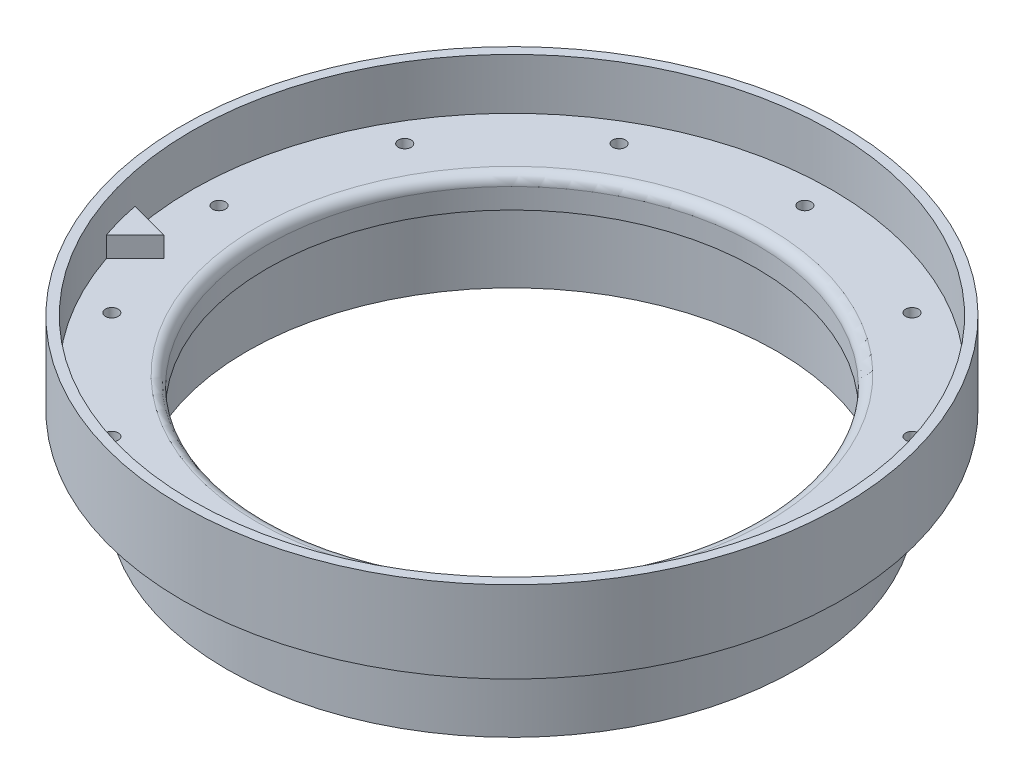
ISO-10303-21;
HEADER;
FILE_DESCRIPTION(('STEP AP214'),'2;1');
FILE_NAME('part.step','',(''),(''),'','','');
FILE_SCHEMA(('AUTOMOTIVE_DESIGN { 1 0 10303 214 1 1 1 1 }'));
ENDSEC;
DATA;
#1=APPLICATION_CONTEXT('core data for automotive mechanical design processes');
#2=APPLICATION_PROTOCOL_DEFINITION('international standard','automotive_design',2000,#1);
#3=PRODUCT_CONTEXT('',#1,'mechanical');
#4=PRODUCT('Part','Part','',(#3));
#5=PRODUCT_RELATED_PRODUCT_CATEGORY('part','',(#4));
#6=PRODUCT_DEFINITION_FORMATION('','',#4);
#7=PRODUCT_DEFINITION_CONTEXT('part definition',#1,'design');
#8=PRODUCT_DEFINITION('design','',#6,#7);
#9=PRODUCT_DEFINITION_SHAPE('','',#8);
#10=(LENGTH_UNIT() NAMED_UNIT(*) SI_UNIT(.MILLI.,.METRE.));
#11=(NAMED_UNIT(*) PLANE_ANGLE_UNIT() SI_UNIT($,.RADIAN.));
#12=(NAMED_UNIT(*) SI_UNIT($,.STERADIAN.) SOLID_ANGLE_UNIT());
#13=UNCERTAINTY_MEASURE_WITH_UNIT(LENGTH_MEASURE(1.E-05),#10,'distance_accuracy_value','');
#14=(GEOMETRIC_REPRESENTATION_CONTEXT(3) GLOBAL_UNCERTAINTY_ASSIGNED_CONTEXT((#13)) GLOBAL_UNIT_ASSIGNED_CONTEXT((#10,
#11,#12)) REPRESENTATION_CONTEXT('',''));
#15=CARTESIAN_POINT('',(0.,0.,0.));
#16=DIRECTION('',(0.,0.,1.));
#17=DIRECTION('',(1.,0.,0.));
#18=AXIS2_PLACEMENT_3D('',#15,#16,#17);
#19=CARTESIAN_POINT('',(0.,55.,0.));
#20=DIRECTION('',(0.,1.,0.));
#21=DIRECTION('',(0.,0.,1.));
#22=AXIS2_PLACEMENT_3D('',#19,#20,#21);
#23=CYLINDRICAL_SURFACE('',#22,49.784);
#24=CARTESIAN_POINT('',(0.,9.525,0.));
#25=DIRECTION('',(0.,1.,0.));
#26=DIRECTION('',(0.,0.,1.));
#27=AXIS2_PLACEMENT_3D('',#24,#25,#26);
#28=CIRCLE('',#27,49.784);
#29=CARTESIAN_POINT('',(0.,9.525,49.784));
#30=VERTEX_POINT('',#29);
#31=EDGE_CURVE('E169',#30,#30,#28,.T.);
#32=ORIENTED_EDGE('',*,*,#31,.T.);
#33=EDGE_LOOP('',(#32));
#34=FACE_BOUND('',#33,.T.);
#35=CARTESIAN_POINT('',(0.,1.5875,0.));
#36=DIRECTION('',(0.,1.,0.));
#37=DIRECTION('',(0.,0.,1.));
#38=AXIS2_PLACEMENT_3D('',#35,#36,#37);
#39=CIRCLE('',#38,49.784);
#40=CARTESIAN_POINT('',(-47.1680073957675,1.5875,15.9256313630832));
#41=VERTEX_POINT('',#40);
#42=CARTESIAN_POINT('',(-48.8115083321686,1.5875,9.79200236614763));
#43=VERTEX_POINT('',#42);
#44=EDGE_CURVE('E86',#41,#43,#39,.T.);
#45=ORIENTED_EDGE('',*,*,#44,.F.);
#46=DIRECTION('',(0.,-1.,0.));
#47=VECTOR('',#46,1.);
#48=CARTESIAN_POINT('',(-47.1680073957675,4.7625,15.9256313630832));
#49=LINE('',#48,#47);
#50=CARTESIAN_POINT('',(-47.1680073957675,4.7625,15.9256313630832));
#51=VERTEX_POINT('',#50);
#52=EDGE_CURVE('E76',#51,#41,#49,.T.);
#53=ORIENTED_EDGE('',*,*,#52,.F.);
#54=CARTESIAN_POINT('',(0.,4.7625,0.));
#55=DIRECTION('',(0.,1.,0.));
#56=DIRECTION('',(0.,0.,-1.));
#57=AXIS2_PLACEMENT_3D('',#54,#55,#56);
#58=CIRCLE('',#57,49.784);
#59=CARTESIAN_POINT('',(-48.8115083321686,4.7625,9.79200236614763));
#60=VERTEX_POINT('',#59);
#61=EDGE_CURVE('E78',#60,#51,#58,.T.);
#62=ORIENTED_EDGE('',*,*,#61,.F.);
#63=DIRECTION('',(0.,-1.,0.));
#64=VECTOR('',#63,1.);
#65=CARTESIAN_POINT('',(-48.8115083321686,4.7625,9.79200236614763));
#66=LINE('',#65,#64);
#67=EDGE_CURVE('E92',#60,#43,#66,.T.);
#68=ORIENTED_EDGE('',*,*,#67,.T.);
#69=EDGE_LOOP('',(#45,#53,#62,#68));
#70=FACE_BOUND('',#69,.T.);
#71=ADVANCED_FACE('F34',(#34,#70),#23,.F.);
#72=CARTESIAN_POINT('',(-39.6875,1.5875,0.));
#73=DIRECTION('',(0.,1.,0.));
#74=DIRECTION('',(0.,0.,1.));
#75=AXIS2_PLACEMENT_3D('',#72,#73,#74);
#76=PLANE('',#75);
#77=CARTESIAN_POINT('',(-39.4517006668589,1.58750000000002,-22.7774500000014));
#78=DIRECTION('',(0.,1.,0.));
#79=DIRECTION('',(0.,0.,1.));
#80=AXIS2_PLACEMENT_3D('',#77,#78,#79);
#81=CIRCLE('',#80,0.996949999999996);
#82=CARTESIAN_POINT('',(-39.4517006668589,1.58750000000002,-21.7805000000015));
#83=VERTEX_POINT('',#82);
#84=EDGE_CURVE('E87',#83,#83,#81,.T.);
#85=ORIENTED_EDGE('',*,*,#84,.F.);
#86=EDGE_LOOP('',(#85));
#87=FACE_BOUND('',#86,.T.);
#88=CARTESIAN_POINT('',(-22.7774499999985,1.58750000000008,-39.4517006668606));
#89=DIRECTION('',(0.,1.,0.));
#90=DIRECTION('',(0.,0.,1.));
#91=AXIS2_PLACEMENT_3D('',#88,#89,#90);
#92=CIRCLE('',#91,0.996949999999996);
#93=CARTESIAN_POINT('',(-22.7774499999985,1.58750000000007,-38.4547506668606));
#94=VERTEX_POINT('',#93);
#95=EDGE_CURVE('E98',#94,#94,#92,.T.);
#96=ORIENTED_EDGE('',*,*,#95,.F.);
#97=EDGE_LOOP('',(#96));
#98=FACE_BOUND('',#97,.T.);
#99=CARTESIAN_POINT('',(1.78253453346917E-12,1.58750000000016,-45.5549));
#100=DIRECTION('',(0.,1.,0.));
#101=DIRECTION('',(0.,0.,1.));
#102=AXIS2_PLACEMENT_3D('',#99,#100,#101);
#103=CIRCLE('',#102,0.996949999999998);
#104=CARTESIAN_POINT('',(1.78253453346917E-12,1.58750000000015,-44.55795));
#105=VERTEX_POINT('',#104);
#106=EDGE_CURVE('E104',#105,#105,#103,.T.);
#107=ORIENTED_EDGE('',*,*,#106,.F.);
#108=EDGE_LOOP('',(#107));
#109=FACE_BOUND('',#108,.T.);
#110=CARTESIAN_POINT('',(22.7774500000016,1.58750000000024,-39.4517006668588));
#111=DIRECTION('',(0.,1.,0.));
#112=DIRECTION('',(0.,0.,1.));
#113=AXIS2_PLACEMENT_3D('',#110,#111,#112);
#114=CIRCLE('',#113,0.996949999999996);
#115=CARTESIAN_POINT('',(22.7774500000016,1.58750000000023,-38.4547506668588));
#116=VERTEX_POINT('',#115);
#117=EDGE_CURVE('E110',#116,#116,#114,.T.);
#118=ORIENTED_EDGE('',*,*,#117,.F.);
#119=EDGE_LOOP('',(#118));
#120=FACE_BOUND('',#119,.T.);
#121=CARTESIAN_POINT('',(39.4517006668607,1.5875000000003,-22.7774499999984));
#122=DIRECTION('',(0.,1.,0.));
#123=DIRECTION('',(0.,0.,1.));
#124=AXIS2_PLACEMENT_3D('',#121,#122,#123);
#125=CIRCLE('',#124,0.996949999999996);
#126=CARTESIAN_POINT('',(39.4517006668607,1.58750000000029,-21.7804999999984));
#127=VERTEX_POINT('',#126);
#128=EDGE_CURVE('E113',#127,#127,#125,.T.);
#129=ORIENTED_EDGE('',*,*,#128,.F.);
#130=EDGE_LOOP('',(#129));
#131=FACE_BOUND('',#130,.T.);
#132=CARTESIAN_POINT('',(45.5549,1.58750000000032,2.26523950982318E-12));
#133=DIRECTION('',(0.,1.,0.));
#134=DIRECTION('',(0.,0.,1.));
#135=AXIS2_PLACEMENT_3D('',#132,#133,#134);
#136=CIRCLE('',#135,0.996949999999996);
#137=CARTESIAN_POINT('',(45.5549,1.58750000000032,0.996950000002262));
#138=VERTEX_POINT('',#137);
#139=EDGE_CURVE('E119',#138,#138,#136,.T.);
#140=ORIENTED_EDGE('',*,*,#139,.F.);
#141=EDGE_LOOP('',(#140));
#142=FACE_BOUND('',#141,.T.);
#143=CARTESIAN_POINT('',(39.4517006668587,1.5875000000003,22.7774500000017));
#144=DIRECTION('',(0.,1.,0.));
#145=DIRECTION('',(0.,0.,1.));
#146=AXIS2_PLACEMENT_3D('',#143,#144,#145);
#147=CIRCLE('',#146,0.996949999999996);
#148=CARTESIAN_POINT('',(39.4517006668587,1.5875000000003,23.7744000000017));
#149=VERTEX_POINT('',#148);
#150=EDGE_CURVE('E125',#149,#149,#147,.T.);
#151=ORIENTED_EDGE('',*,*,#150,.F.);
#152=EDGE_LOOP('',(#151));
#153=FACE_BOUND('',#152,.T.);
#154=CARTESIAN_POINT('',(22.7774499999982,1.58750000000024,39.4517006668607));
#155=DIRECTION('',(0.,1.,0.));
#156=DIRECTION('',(0.,0.,1.));
#157=AXIS2_PLACEMENT_3D('',#154,#155,#156);
#158=CIRCLE('',#157,0.996949999999996);
#159=CARTESIAN_POINT('',(22.7774499999982,1.58750000000024,40.4486506668607));
#160=VERTEX_POINT('',#159);
#161=EDGE_CURVE('E129',#160,#160,#158,.T.);
#162=ORIENTED_EDGE('',*,*,#161,.F.);
#163=EDGE_LOOP('',(#162));
#164=FACE_BOUND('',#163,.T.);
#165=CARTESIAN_POINT('',(-2.11172815320573E-12,1.58750000000016,45.5549));
#166=DIRECTION('',(0.,1.,0.));
#167=DIRECTION('',(0.,0.,1.));
#168=AXIS2_PLACEMENT_3D('',#165,#166,#167);
#169=CIRCLE('',#168,0.996949999999998);
#170=CARTESIAN_POINT('',(-2.11172815320573E-12,1.58750000000016,46.55185));
#171=VERTEX_POINT('',#170);
#172=EDGE_CURVE('E135',#171,#171,#169,.T.);
#173=ORIENTED_EDGE('',*,*,#172,.F.);
#174=EDGE_LOOP('',(#173));
#175=FACE_BOUND('',#174,.T.);
#176=CARTESIAN_POINT('',(-22.7774500000019,1.58750000000008,39.4517006668586));
#177=DIRECTION('',(0.,1.,0.));
#178=DIRECTION('',(0.,0.,1.));
#179=AXIS2_PLACEMENT_3D('',#176,#177,#178);
#180=CIRCLE('',#179,0.996949999999996);
#181=CARTESIAN_POINT('',(-22.7774500000019,1.58750000000008,40.4486506668586));
#182=VERTEX_POINT('',#181);
#183=EDGE_CURVE('E141',#182,#182,#180,.T.);
#184=ORIENTED_EDGE('',*,*,#183,.F.);
#185=EDGE_LOOP('',(#184));
#186=FACE_BOUND('',#185,.T.);
#187=CARTESIAN_POINT('',(-39.4517006668608,1.58750000000002,22.7774499999981));
#188=DIRECTION('',(0.,1.,0.));
#189=DIRECTION('',(0.,0.,1.));
#190=AXIS2_PLACEMENT_3D('',#187,#188,#189);
#191=CIRCLE('',#190,0.996949999999996);
#192=CARTESIAN_POINT('',(-39.4517006668608,1.58750000000002,23.7743999999981));
#193=VERTEX_POINT('',#192);
#194=EDGE_CURVE('E147',#193,#193,#191,.T.);
#195=ORIENTED_EDGE('',*,*,#194,.F.);
#196=EDGE_LOOP('',(#195));
#197=FACE_BOUND('',#196,.T.);
#198=CARTESIAN_POINT('',(-45.5549,1.5875,-2.26523950982318E-12));
#199=DIRECTION('',(0.,1.,0.));
#200=DIRECTION('',(0.,0.,1.));
#201=AXIS2_PLACEMENT_3D('',#198,#199,#200);
#202=CIRCLE('',#201,0.996949999999996);
#203=CARTESIAN_POINT('',(-45.5549,1.5875,0.996949999997731));
#204=VERTEX_POINT('',#203);
#205=EDGE_CURVE('E153',#204,#204,#202,.T.);
#206=ORIENTED_EDGE('',*,*,#205,.F.);
#207=EDGE_LOOP('',(#206));
#208=FACE_BOUND('',#207,.T.);
#209=CARTESIAN_POINT('',(0.,1.5875,0.));
#210=DIRECTION('',(0.,1.,0.));
#211=DIRECTION('',(0.,0.,1.));
#212=AXIS2_PLACEMENT_3D('',#209,#210,#211);
#213=CIRCLE('',#212,39.6875);
#214=CARTESIAN_POINT('',(0.,1.5875,39.6875));
#215=VERTEX_POINT('',#214);
#216=EDGE_CURVE('E165',#215,#215,#213,.T.);
#217=ORIENTED_EDGE('',*,*,#216,.F.);
#218=EDGE_LOOP('',(#217));
#219=FACE_BOUND('',#218,.T.);
#220=DIRECTION('',(-0.96592582628907,0.,-0.258819045102516));
#221=VECTOR('',#220,1.);
#222=CARTESIAN_POINT('',(-42.677879335233,1.5875,11.4355033025486));
#223=LINE('',#222,#221);
#224=CARTESIAN_POINT('',(-42.677879335233,1.5875,11.4355033025486));
#225=VERTEX_POINT('',#224);
#226=EDGE_CURVE('E69',#225,#43,#223,.T.);
#227=ORIENTED_EDGE('',*,*,#226,.F.);
#228=DIRECTION('',(0.707106781186547,0.,-0.707106781186547));
#229=VECTOR('',#228,1.);
#230=CARTESIAN_POINT('',(-47.1680073957675,1.5875,15.9256313630832));
#231=LINE('',#230,#229);
#232=EDGE_CURVE('E519',#41,#225,#231,.T.);
#233=ORIENTED_EDGE('',*,*,#232,.F.);
#234=ORIENTED_EDGE('',*,*,#44,.T.);
#235=EDGE_LOOP('',(#227,#233,#234));
#236=FACE_BOUND('',#235,.T.);
#237=ADVANCED_FACE('F225',(#87,#98,#109,#120,#131,#142,#153,#164,#175,#186,#197,#208,#219,#236),
#76,.T.);
#238=CARTESIAN_POINT('',(-38.1,-3.175,0.));
#239=DIRECTION('',(0.,-1.,0.));
#240=DIRECTION('',(0.,0.,-1.));
#241=AXIS2_PLACEMENT_3D('',#238,#239,#240);
#242=PLANE('',#241);
#243=CARTESIAN_POINT('',(0.,-3.175,0.));
#244=DIRECTION('',(0.,1.,0.));
#245=DIRECTION('',(0.,0.,1.));
#246=AXIS2_PLACEMENT_3D('',#243,#244,#245);
#247=CIRCLE('',#246,38.1);
#248=CARTESIAN_POINT('',(0.,-3.175,38.1));
#249=VERTEX_POINT('',#248);
#250=EDGE_CURVE('E159',#249,#249,#247,.T.);
#251=ORIENTED_EDGE('',*,*,#250,.T.);
#252=EDGE_LOOP('',(#251));
#253=FACE_BOUND('',#252,.T.);
#254=CARTESIAN_POINT('',(0.,-3.175,0.));
#255=DIRECTION('',(0.,1.,0.));
#256=DIRECTION('',(0.,0.,1.));
#257=AXIS2_PLACEMENT_3D('',#254,#255,#256);
#258=CIRCLE('',#257,41.2242);
#259=CARTESIAN_POINT('',(0.,-3.175,41.2242));
#260=VERTEX_POINT('',#259);
#261=EDGE_CURVE('E11',#260,#260,#258,.T.);
#262=ORIENTED_EDGE('',*,*,#261,.F.);
#263=EDGE_LOOP('',(#262));
#264=FACE_BOUND('',#263,.T.);
#265=ADVANCED_FACE('F36',(#253,#264),#242,.T.);
#266=CARTESIAN_POINT('',(0.,55.,0.));
#267=DIRECTION('',(0.,1.,0.));
#268=DIRECTION('',(0.,0.,1.));
#269=AXIS2_PLACEMENT_3D('',#266,#267,#268);
#270=CYLINDRICAL_SURFACE('',#269,41.2242);
#271=ORIENTED_EDGE('',*,*,#261,.T.);
#272=EDGE_LOOP('',(#271));
#273=FACE_BOUND('',#272,.T.);
#274=CARTESIAN_POINT('',(0.,-15.875,0.));
#275=DIRECTION('',(0.,1.,0.));
#276=DIRECTION('',(0.,0.,1.));
#277=AXIS2_PLACEMENT_3D('',#274,#275,#276);
#278=CIRCLE('',#277,41.2242);
#279=CARTESIAN_POINT('',(0.,-15.875,41.2242));
#280=VERTEX_POINT('',#279);
#281=EDGE_CURVE('E43',#280,#280,#278,.T.);
#282=ORIENTED_EDGE('',*,*,#281,.F.);
#283=EDGE_LOOP('',(#282));
#284=FACE_BOUND('',#283,.T.);
#285=ADVANCED_FACE('F239',(#273,#284),#270,.F.);
#286=CARTESIAN_POINT('',(-44.3992,-15.875,0.));
#287=DIRECTION('',(0.,-1.,0.));
#288=DIRECTION('',(0.,0.,-1.));
#289=AXIS2_PLACEMENT_3D('',#286,#287,#288);
#290=PLANE('',#289);
#291=ORIENTED_EDGE('',*,*,#281,.T.);
#292=EDGE_LOOP('',(#291));
#293=FACE_BOUND('',#292,.T.);
#294=CARTESIAN_POINT('',(0.,-15.875,0.));
#295=DIRECTION('',(0.,1.,0.));
#296=DIRECTION('',(0.,0.,1.));
#297=AXIS2_PLACEMENT_3D('',#294,#295,#296);
#298=CIRCLE('',#297,44.3992);
#299=CARTESIAN_POINT('',(0.,-15.875,44.3992));
#300=VERTEX_POINT('',#299);
#301=EDGE_CURVE('E181',#300,#300,#298,.T.);
#302=ORIENTED_EDGE('',*,*,#301,.F.);
#303=EDGE_LOOP('',(#302));
#304=FACE_BOUND('',#303,.T.);
#305=ADVANCED_FACE('F236',(#293,#304),#290,.T.);
#306=CARTESIAN_POINT('',(0.,55.,0.));
#307=DIRECTION('',(0.,1.,0.));
#308=DIRECTION('',(0.,0.,1.));
#309=AXIS2_PLACEMENT_3D('',#306,#307,#308);
#310=CYLINDRICAL_SURFACE('',#309,44.3992);
#311=ORIENTED_EDGE('',*,*,#301,.T.);
#312=EDGE_LOOP('',(#311));
#313=FACE_BOUND('',#312,.T.);
#314=CARTESIAN_POINT('',(0.,-3.175,0.));
#315=DIRECTION('',(0.,1.,0.));
#316=DIRECTION('',(0.,0.,1.));
#317=AXIS2_PLACEMENT_3D('',#314,#315,#316);
#318=CIRCLE('',#317,44.3992);
#319=CARTESIAN_POINT('',(0.,-3.175,44.3992));
#320=VERTEX_POINT('',#319);
#321=EDGE_CURVE('E178',#320,#320,#318,.T.);
#322=ORIENTED_EDGE('',*,*,#321,.F.);
#323=EDGE_LOOP('',(#322));
#324=FACE_BOUND('',#323,.T.);
#325=ADVANCED_FACE('F195',(#313,#324),#310,.T.);
#326=CARTESIAN_POINT('',(-44.3992,-3.175,0.));
#327=DIRECTION('',(0.,-1.,0.));
#328=DIRECTION('',(0.,0.,-1.));
#329=AXIS2_PLACEMENT_3D('',#326,#327,#328);
#330=PLANE('',#329);
#331=CARTESIAN_POINT('',(-39.4517006668589,-3.175,-22.7774500000015));
#332=DIRECTION('',(0.,-1.,0.));
#333=DIRECTION('',(0.,0.,-1.));
#334=AXIS2_PLACEMENT_3D('',#331,#332,#333);
#335=CIRCLE('',#334,0.996949999999996);
#336=CARTESIAN_POINT('',(-39.4517006668589,-3.175,-23.7744000000015));
#337=VERTEX_POINT('',#336);
#338=EDGE_CURVE('E90',#337,#337,#335,.T.);
#339=ORIENTED_EDGE('',*,*,#338,.F.);
#340=EDGE_LOOP('',(#339));
#341=FACE_BOUND('',#340,.T.);
#342=CARTESIAN_POINT('',(-22.7774499999985,-3.175,-39.4517006668606));
#343=DIRECTION('',(0.,-1.,0.));
#344=DIRECTION('',(0.,0.,-1.));
#345=AXIS2_PLACEMENT_3D('',#342,#343,#344);
#346=CIRCLE('',#345,0.996949999999996);
#347=CARTESIAN_POINT('',(-22.7774499999985,-3.175,-40.4486506668606));
#348=VERTEX_POINT('',#347);
#349=EDGE_CURVE('E101',#348,#348,#346,.T.);
#350=ORIENTED_EDGE('',*,*,#349,.F.);
#351=EDGE_LOOP('',(#350));
#352=FACE_BOUND('',#351,.T.);
#353=CARTESIAN_POINT('',(1.78253453346917E-12,-3.175,-45.5549));
#354=DIRECTION('',(0.,-1.,0.));
#355=DIRECTION('',(0.,0.,-1.));
#356=AXIS2_PLACEMENT_3D('',#353,#354,#355);
#357=CIRCLE('',#356,0.996949999999996);
#358=CARTESIAN_POINT('',(1.78253453346917E-12,-3.175,-46.55185));
#359=VERTEX_POINT('',#358);
#360=EDGE_CURVE('E107',#359,#359,#357,.T.);
#361=ORIENTED_EDGE('',*,*,#360,.F.);
#362=EDGE_LOOP('',(#361));
#363=FACE_BOUND('',#362,.T.);
#364=CARTESIAN_POINT('',(22.7774500000016,-3.175,-39.4517006668588));
#365=DIRECTION('',(0.,-1.,0.));
#366=DIRECTION('',(0.,0.,-1.));
#367=AXIS2_PLACEMENT_3D('',#364,#365,#366);
#368=CIRCLE('',#367,0.996949999999996);
#369=CARTESIAN_POINT('',(22.7774500000016,-3.175,-40.4486506668588));
#370=VERTEX_POINT('',#369);
#371=EDGE_CURVE('E38',#370,#370,#368,.T.);
#372=ORIENTED_EDGE('',*,*,#371,.F.);
#373=EDGE_LOOP('',(#372));
#374=FACE_BOUND('',#373,.T.);
#375=CARTESIAN_POINT('',(39.4517006668607,-3.175,-22.7774499999984));
#376=DIRECTION('',(0.,-1.,0.));
#377=DIRECTION('',(0.,0.,-1.));
#378=AXIS2_PLACEMENT_3D('',#375,#376,#377);
#379=CIRCLE('',#378,0.996949999999996);
#380=CARTESIAN_POINT('',(39.4517006668607,-3.175,-23.7743999999984));
#381=VERTEX_POINT('',#380);
#382=EDGE_CURVE('E116',#381,#381,#379,.T.);
#383=ORIENTED_EDGE('',*,*,#382,.F.);
#384=EDGE_LOOP('',(#383));
#385=FACE_BOUND('',#384,.T.);
#386=CARTESIAN_POINT('',(45.5549,-3.175,2.26523950982318E-12));
#387=DIRECTION('',(0.,-1.,0.));
#388=DIRECTION('',(0.,0.,-1.));
#389=AXIS2_PLACEMENT_3D('',#386,#387,#388);
#390=CIRCLE('',#389,0.996949999999996);
#391=CARTESIAN_POINT('',(45.5549,-3.175,-0.996949999997731));
#392=VERTEX_POINT('',#391);
#393=EDGE_CURVE('E122',#392,#392,#390,.T.);
#394=ORIENTED_EDGE('',*,*,#393,.F.);
#395=EDGE_LOOP('',(#394));
#396=FACE_BOUND('',#395,.T.);
#397=CARTESIAN_POINT('',(39.4517006668587,-3.175,22.7774500000017));
#398=DIRECTION('',(0.,-1.,0.));
#399=DIRECTION('',(0.,0.,-1.));
#400=AXIS2_PLACEMENT_3D('',#397,#398,#399);
#401=CIRCLE('',#400,0.996949999999996);
#402=CARTESIAN_POINT('',(39.4517006668587,-3.175,21.7805000000017));
#403=VERTEX_POINT('',#402);
#404=EDGE_CURVE('E128',#403,#403,#401,.T.);
#405=ORIENTED_EDGE('',*,*,#404,.F.);
#406=EDGE_LOOP('',(#405));
#407=FACE_BOUND('',#406,.T.);
#408=CARTESIAN_POINT('',(22.7774499999982,-3.175,39.4517006668608));
#409=DIRECTION('',(0.,-1.,0.));
#410=DIRECTION('',(0.,0.,-1.));
#411=AXIS2_PLACEMENT_3D('',#408,#409,#410);
#412=CIRCLE('',#411,0.996949999999996);
#413=CARTESIAN_POINT('',(22.7774499999982,-3.175,38.4547506668608));
#414=VERTEX_POINT('',#413);
#415=EDGE_CURVE('E132',#414,#414,#412,.T.);
#416=ORIENTED_EDGE('',*,*,#415,.F.);
#417=EDGE_LOOP('',(#416));
#418=FACE_BOUND('',#417,.T.);
#419=CARTESIAN_POINT('',(-2.11172815320573E-12,-3.175,45.5549));
#420=DIRECTION('',(0.,-1.,0.));
#421=DIRECTION('',(0.,0.,-1.));
#422=AXIS2_PLACEMENT_3D('',#419,#420,#421);
#423=CIRCLE('',#422,0.996949999999996);
#424=CARTESIAN_POINT('',(-2.11172815320573E-12,-3.175,44.55795));
#425=VERTEX_POINT('',#424);
#426=EDGE_CURVE('E138',#425,#425,#423,.T.);
#427=ORIENTED_EDGE('',*,*,#426,.F.);
#428=EDGE_LOOP('',(#427));
#429=FACE_BOUND('',#428,.T.);
#430=CARTESIAN_POINT('',(-22.7774500000019,-3.175,39.4517006668586));
#431=DIRECTION('',(0.,-1.,0.));
#432=DIRECTION('',(0.,0.,-1.));
#433=AXIS2_PLACEMENT_3D('',#430,#431,#432);
#434=CIRCLE('',#433,0.996949999999996);
#435=CARTESIAN_POINT('',(-22.7774500000019,-3.175,38.4547506668587));
#436=VERTEX_POINT('',#435);
#437=EDGE_CURVE('E144',#436,#436,#434,.T.);
#438=ORIENTED_EDGE('',*,*,#437,.F.);
#439=EDGE_LOOP('',(#438));
#440=FACE_BOUND('',#439,.T.);
#441=CARTESIAN_POINT('',(-39.4517006668608,-3.175,22.7774499999981));
#442=DIRECTION('',(0.,-1.,0.));
#443=DIRECTION('',(0.,0.,-1.));
#444=AXIS2_PLACEMENT_3D('',#441,#442,#443);
#445=CIRCLE('',#444,0.996949999999996);
#446=CARTESIAN_POINT('',(-39.4517006668608,-3.175,21.7804999999981));
#447=VERTEX_POINT('',#446);
#448=EDGE_CURVE('E150',#447,#447,#445,.T.);
#449=ORIENTED_EDGE('',*,*,#448,.F.);
#450=EDGE_LOOP('',(#449));
#451=FACE_BOUND('',#450,.T.);
#452=CARTESIAN_POINT('',(-45.5549,-3.175,-2.26523950982318E-12));
#453=DIRECTION('',(0.,-1.,0.));
#454=DIRECTION('',(0.,0.,-1.));
#455=AXIS2_PLACEMENT_3D('',#452,#453,#454);
#456=CIRCLE('',#455,0.996949999999996);
#457=CARTESIAN_POINT('',(-45.5549,-3.175,-0.996950000002262));
#458=VERTEX_POINT('',#457);
#459=EDGE_CURVE('E156',#458,#458,#456,.T.);
#460=ORIENTED_EDGE('',*,*,#459,.F.);
#461=EDGE_LOOP('',(#460));
#462=FACE_BOUND('',#461,.T.);
#463=ORIENTED_EDGE('',*,*,#321,.T.);
#464=EDGE_LOOP('',(#463));
#465=FACE_BOUND('',#464,.T.);
#466=CARTESIAN_POINT('',(0.,-3.175,0.));
#467=DIRECTION('',(0.,1.,0.));
#468=DIRECTION('',(0.,0.,1.));
#469=AXIS2_PLACEMENT_3D('',#466,#467,#468);
#470=CIRCLE('',#469,51.2572);
#471=CARTESIAN_POINT('',(0.,-3.175,51.2572));
#472=VERTEX_POINT('',#471);
#473=EDGE_CURVE('E175',#472,#472,#470,.T.);
#474=ORIENTED_EDGE('',*,*,#473,.F.);
#475=EDGE_LOOP('',(#474));
#476=FACE_BOUND('',#475,.T.);
#477=ADVANCED_FACE('F191',(#341,#352,#363,#374,#385,#396,#407,#418,#429,#440,#451,#462,#465,
#476),#330,.T.);
#478=CARTESIAN_POINT('',(0.,55.,0.));
#479=DIRECTION('',(0.,1.,0.));
#480=DIRECTION('',(0.,0.,1.));
#481=AXIS2_PLACEMENT_3D('',#478,#479,#480);
#482=CYLINDRICAL_SURFACE('',#481,51.2572);
#483=ORIENTED_EDGE('',*,*,#473,.T.);
#484=EDGE_LOOP('',(#483));
#485=FACE_BOUND('',#484,.T.);
#486=CARTESIAN_POINT('',(0.,9.525,0.));
#487=DIRECTION('',(0.,1.,0.));
#488=DIRECTION('',(0.,0.,1.));
#489=AXIS2_PLACEMENT_3D('',#486,#487,#488);
#490=CIRCLE('',#489,51.2572);
#491=CARTESIAN_POINT('',(0.,9.525,51.2572));
#492=VERTEX_POINT('',#491);
#493=EDGE_CURVE('E172',#492,#492,#490,.T.);
#494=ORIENTED_EDGE('',*,*,#493,.F.);
#495=EDGE_LOOP('',(#494));
#496=FACE_BOUND('',#495,.T.);
#497=ADVANCED_FACE('F194',(#485,#496),#482,.T.);
#498=CARTESIAN_POINT('',(-51.2572,9.525,0.));
#499=DIRECTION('',(0.,1.,0.));
#500=DIRECTION('',(0.,0.,1.));
#501=AXIS2_PLACEMENT_3D('',#498,#499,#500);
#502=PLANE('',#501);
#503=ORIENTED_EDGE('',*,*,#493,.T.);
#504=EDGE_LOOP('',(#503));
#505=FACE_BOUND('',#504,.T.);
#506=ORIENTED_EDGE('',*,*,#31,.F.);
#507=EDGE_LOOP('',(#506));
#508=FACE_BOUND('',#507,.T.);
#509=ADVANCED_FACE('F214',(#505,#508),#502,.T.);
#510=CARTESIAN_POINT('',(0.,0.,0.));
#511=DIRECTION('',(0.,1.,0.));
#512=DIRECTION('',(0.,0.,1.));
#513=AXIS2_PLACEMENT_3D('',#510,#511,#512);
#514=TOROIDAL_SURFACE('',#513,39.6875,1.5875);
#515=ORIENTED_EDGE('',*,*,#216,.T.);
#516=EDGE_LOOP('',(#515));
#517=FACE_BOUND('',#516,.T.);
#518=CARTESIAN_POINT('',(0.,0.,0.));
#519=DIRECTION('',(0.,1.,0.));
#520=DIRECTION('',(0.,0.,1.));
#521=AXIS2_PLACEMENT_3D('',#518,#519,#520);
#522=CIRCLE('',#521,38.1);
#523=CARTESIAN_POINT('',(0.,0.,38.1));
#524=VERTEX_POINT('',#523);
#525=EDGE_CURVE('E162',#524,#524,#522,.T.);
#526=ORIENTED_EDGE('',*,*,#525,.F.);
#527=EDGE_LOOP('',(#526));
#528=FACE_BOUND('',#527,.T.);
#529=ADVANCED_FACE('F220',(#517,#528),#514,.T.);
#530=CARTESIAN_POINT('',(0.,55.,0.));
#531=DIRECTION('',(0.,1.,0.));
#532=DIRECTION('',(0.,0.,1.));
#533=AXIS2_PLACEMENT_3D('',#530,#531,#532);
#534=CYLINDRICAL_SURFACE('',#533,38.1);
#535=ORIENTED_EDGE('',*,*,#525,.T.);
#536=EDGE_LOOP('',(#535));
#537=FACE_BOUND('',#536,.T.);
#538=ORIENTED_EDGE('',*,*,#250,.F.);
#539=EDGE_LOOP('',(#538));
#540=FACE_BOUND('',#539,.T.);
#541=ADVANCED_FACE('F258',(#537,#540),#534,.F.);
#542=CARTESIAN_POINT('',(-45.5549,1.5875,-2.26523950982318E-12));
#543=DIRECTION('',(0.,1.,0.));
#544=DIRECTION('',(0.,0.,1.));
#545=AXIS2_PLACEMENT_3D('',#542,#543,#544);
#546=CYLINDRICAL_SURFACE('',#545,0.996949999999996);
#547=ORIENTED_EDGE('',*,*,#459,.T.);
#548=EDGE_LOOP('',(#547));
#549=FACE_BOUND('',#548,.T.);
#550=ORIENTED_EDGE('',*,*,#205,.T.);
#551=EDGE_LOOP('',(#550));
#552=FACE_BOUND('',#551,.T.);
#553=ADVANCED_FACE('F260',(#549,#552),#546,.F.);
#554=CARTESIAN_POINT('',(-39.4517006668608,1.58750000000002,22.7774499999981));
#555=DIRECTION('',(0.,1.,0.));
#556=DIRECTION('',(0.,0.,1.));
#557=AXIS2_PLACEMENT_3D('',#554,#555,#556);
#558=CYLINDRICAL_SURFACE('',#557,0.996949999999996);
#559=ORIENTED_EDGE('',*,*,#448,.T.);
#560=EDGE_LOOP('',(#559));
#561=FACE_BOUND('',#560,.T.);
#562=ORIENTED_EDGE('',*,*,#194,.T.);
#563=EDGE_LOOP('',(#562));
#564=FACE_BOUND('',#563,.T.);
#565=ADVANCED_FACE('F267',(#561,#564),#558,.F.);
#566=CARTESIAN_POINT('',(-22.7774500000019,1.58750000000008,39.4517006668586));
#567=DIRECTION('',(0.,1.,0.));
#568=DIRECTION('',(0.,0.,1.));
#569=AXIS2_PLACEMENT_3D('',#566,#567,#568);
#570=CYLINDRICAL_SURFACE('',#569,0.996949999999996);
#571=ORIENTED_EDGE('',*,*,#437,.T.);
#572=EDGE_LOOP('',(#571));
#573=FACE_BOUND('',#572,.T.);
#574=ORIENTED_EDGE('',*,*,#183,.T.);
#575=EDGE_LOOP('',(#574));
#576=FACE_BOUND('',#575,.T.);
#577=ADVANCED_FACE('F274',(#573,#576),#570,.F.);
#578=CARTESIAN_POINT('',(-2.11172815320573E-12,1.58750000000016,45.5549));
#579=DIRECTION('',(0.,1.,0.));
#580=DIRECTION('',(0.,0.,1.));
#581=AXIS2_PLACEMENT_3D('',#578,#579,#580);
#582=CYLINDRICAL_SURFACE('',#581,0.996949999999996);
#583=ORIENTED_EDGE('',*,*,#426,.T.);
#584=EDGE_LOOP('',(#583));
#585=FACE_BOUND('',#584,.T.);
#586=ORIENTED_EDGE('',*,*,#172,.T.);
#587=EDGE_LOOP('',(#586));
#588=FACE_BOUND('',#587,.T.);
#589=ADVANCED_FACE('F278',(#585,#588),#582,.F.);
#590=CARTESIAN_POINT('',(22.7774499999982,1.58750000000024,39.4517006668607));
#591=DIRECTION('',(0.,1.,0.));
#592=DIRECTION('',(0.,0.,1.));
#593=AXIS2_PLACEMENT_3D('',#590,#591,#592);
#594=CYLINDRICAL_SURFACE('',#593,0.996949999999996);
#595=ORIENTED_EDGE('',*,*,#415,.T.);
#596=EDGE_LOOP('',(#595));
#597=FACE_BOUND('',#596,.T.);
#598=ORIENTED_EDGE('',*,*,#161,.T.);
#599=EDGE_LOOP('',(#598));
#600=FACE_BOUND('',#599,.T.);
#601=ADVANCED_FACE('F282',(#597,#600),#594,.F.);
#602=CARTESIAN_POINT('',(39.4517006668587,1.5875000000003,22.7774500000017));
#603=DIRECTION('',(0.,1.,0.));
#604=DIRECTION('',(0.,0.,1.));
#605=AXIS2_PLACEMENT_3D('',#602,#603,#604);
#606=CYLINDRICAL_SURFACE('',#605,0.996949999999996);
#607=ORIENTED_EDGE('',*,*,#404,.T.);
#608=EDGE_LOOP('',(#607));
#609=FACE_BOUND('',#608,.T.);
#610=ORIENTED_EDGE('',*,*,#150,.T.);
#611=EDGE_LOOP('',(#610));
#612=FACE_BOUND('',#611,.T.);
#613=ADVANCED_FACE('F188',(#609,#612),#606,.F.);
#614=CARTESIAN_POINT('',(45.5549,1.58750000000032,2.26523950982318E-12));
#615=DIRECTION('',(0.,1.,0.));
#616=DIRECTION('',(0.,0.,1.));
#617=AXIS2_PLACEMENT_3D('',#614,#615,#616);
#618=CYLINDRICAL_SURFACE('',#617,0.996949999999996);
#619=ORIENTED_EDGE('',*,*,#393,.T.);
#620=EDGE_LOOP('',(#619));
#621=FACE_BOUND('',#620,.T.);
#622=ORIENTED_EDGE('',*,*,#139,.T.);
#623=EDGE_LOOP('',(#622));
#624=FACE_BOUND('',#623,.T.);
#625=ADVANCED_FACE('F289',(#621,#624),#618,.F.);
#626=CARTESIAN_POINT('',(39.4517006668607,1.5875000000003,-22.7774499999984));
#627=DIRECTION('',(0.,1.,0.));
#628=DIRECTION('',(0.,0.,1.));
#629=AXIS2_PLACEMENT_3D('',#626,#627,#628);
#630=CYLINDRICAL_SURFACE('',#629,0.996949999999996);
#631=ORIENTED_EDGE('',*,*,#382,.T.);
#632=EDGE_LOOP('',(#631));
#633=FACE_BOUND('',#632,.T.);
#634=ORIENTED_EDGE('',*,*,#128,.T.);
#635=EDGE_LOOP('',(#634));
#636=FACE_BOUND('',#635,.T.);
#637=ADVANCED_FACE('F292',(#633,#636),#630,.F.);
#638=CARTESIAN_POINT('',(22.7774500000016,1.58750000000024,-39.4517006668588));
#639=DIRECTION('',(0.,1.,0.));
#640=DIRECTION('',(0.,0.,1.));
#641=AXIS2_PLACEMENT_3D('',#638,#639,#640);
#642=CYLINDRICAL_SURFACE('',#641,0.996949999999996);
#643=ORIENTED_EDGE('',*,*,#371,.T.);
#644=EDGE_LOOP('',(#643));
#645=FACE_BOUND('',#644,.T.);
#646=ORIENTED_EDGE('',*,*,#117,.T.);
#647=EDGE_LOOP('',(#646));
#648=FACE_BOUND('',#647,.T.);
#649=ADVANCED_FACE('F296',(#645,#648),#642,.F.);
#650=CARTESIAN_POINT('',(1.78253453346917E-12,1.58750000000016,-45.5549));
#651=DIRECTION('',(0.,1.,0.));
#652=DIRECTION('',(0.,0.,1.));
#653=AXIS2_PLACEMENT_3D('',#650,#651,#652);
#654=CYLINDRICAL_SURFACE('',#653,0.996949999999996);
#655=ORIENTED_EDGE('',*,*,#360,.T.);
#656=EDGE_LOOP('',(#655));
#657=FACE_BOUND('',#656,.T.);
#658=ORIENTED_EDGE('',*,*,#106,.T.);
#659=EDGE_LOOP('',(#658));
#660=FACE_BOUND('',#659,.T.);
#661=ADVANCED_FACE('F300',(#657,#660),#654,.F.);
#662=CARTESIAN_POINT('',(-22.7774499999985,1.58750000000008,-39.4517006668606));
#663=DIRECTION('',(0.,1.,0.));
#664=DIRECTION('',(0.,0.,1.));
#665=AXIS2_PLACEMENT_3D('',#662,#663,#664);
#666=CYLINDRICAL_SURFACE('',#665,0.996949999999996);
#667=ORIENTED_EDGE('',*,*,#349,.T.);
#668=EDGE_LOOP('',(#667));
#669=FACE_BOUND('',#668,.T.);
#670=ORIENTED_EDGE('',*,*,#95,.T.);
#671=EDGE_LOOP('',(#670));
#672=FACE_BOUND('',#671,.T.);
#673=ADVANCED_FACE('F304',(#669,#672),#666,.F.);
#674=CARTESIAN_POINT('',(-39.4517006668589,1.58750000000002,-22.7774500000014));
#675=DIRECTION('',(0.,1.,0.));
#676=DIRECTION('',(0.,0.,1.));
#677=AXIS2_PLACEMENT_3D('',#674,#675,#676);
#678=CYLINDRICAL_SURFACE('',#677,0.996949999999996);
#679=ORIENTED_EDGE('',*,*,#338,.T.);
#680=EDGE_LOOP('',(#679));
#681=FACE_BOUND('',#680,.T.);
#682=ORIENTED_EDGE('',*,*,#84,.T.);
#683=EDGE_LOOP('',(#682));
#684=FACE_BOUND('',#683,.T.);
#685=ADVANCED_FACE('F308',(#681,#684),#678,.F.);
#686=CARTESIAN_POINT('',(-47.1680073957675,4.7625,15.9256313630832));
#687=DIRECTION('',(-0.707106781186548,0.,-0.707106781186548));
#688=DIRECTION('',(-0.707106781186548,0.,0.707106781186548));
#689=AXIS2_PLACEMENT_3D('',#686,#687,#688);
#690=PLANE('',#689);
#691=ORIENTED_EDGE('',*,*,#232,.T.);
#692=DIRECTION('',(0.,-1.,0.));
#693=VECTOR('',#692,1.);
#694=CARTESIAN_POINT('',(-42.677879335233,4.7625,11.4355033025486));
#695=LINE('',#694,#693);
#696=CARTESIAN_POINT('',(-42.677879335233,4.7625,11.4355033025486));
#697=VERTEX_POINT('',#696);
#698=EDGE_CURVE('E51',#697,#225,#695,.T.);
#699=ORIENTED_EDGE('',*,*,#698,.F.);
#700=DIRECTION('',(0.707106781186547,0.,-0.707106781186547));
#701=VECTOR('',#700,1.);
#702=CARTESIAN_POINT('',(-47.1680073957675,4.7625,15.9256313630832));
#703=LINE('',#702,#701);
#704=EDGE_CURVE('E73',#51,#697,#703,.T.);
#705=ORIENTED_EDGE('',*,*,#704,.F.);
#706=ORIENTED_EDGE('',*,*,#52,.T.);
#707=EDGE_LOOP('',(#691,#699,#705,#706));
#708=FACE_BOUND('',#707,.T.);
#709=ADVANCED_FACE('F74',(#708),#690,.F.);
#710=CARTESIAN_POINT('',(-42.677879335233,4.7625,11.4355033025486));
#711=DIRECTION('',(-0.258819045102516,0.,0.96592582628907));
#712=DIRECTION('',(0.96592582628907,0.,0.258819045102516));
#713=AXIS2_PLACEMENT_3D('',#710,#711,#712);
#714=PLANE('',#713);
#715=ORIENTED_EDGE('',*,*,#226,.T.);
#716=ORIENTED_EDGE('',*,*,#67,.F.);
#717=DIRECTION('',(-0.96592582628907,0.,-0.258819045102516));
#718=VECTOR('',#717,1.);
#719=CARTESIAN_POINT('',(-42.677879335233,4.7625,11.4355033025486));
#720=LINE('',#719,#718);
#721=EDGE_CURVE('E59',#697,#60,#720,.T.);
#722=ORIENTED_EDGE('',*,*,#721,.F.);
#723=ORIENTED_EDGE('',*,*,#698,.T.);
#724=EDGE_LOOP('',(#715,#716,#722,#723));
#725=FACE_BOUND('',#724,.T.);
#726=ADVANCED_FACE('F315',(#725),#714,.F.);
#727=CARTESIAN_POINT('',(0.,4.7625,0.));
#728=DIRECTION('',(0.,-1.,0.));
#729=DIRECTION('',(0.,0.,-1.));
#730=AXIS2_PLACEMENT_3D('',#727,#728,#729);
#731=PLANE('',#730);
#732=ORIENTED_EDGE('',*,*,#61,.T.);
#733=ORIENTED_EDGE('',*,*,#704,.T.);
#734=ORIENTED_EDGE('',*,*,#721,.T.);
#735=EDGE_LOOP('',(#732,#733,#734));
#736=FACE_BOUND('',#735,.T.);
#737=ADVANCED_FACE('F81',(#736),#731,.F.);
#738=CLOSED_SHELL('',(#71,#237,#265,#285,#305,#325,#477,#497,#509,#529,#541,#553,#565,#577,#589,
#601,#613,#625,#637,#649,#661,#673,#685,#709,#726,#737));
#739=MANIFOLD_SOLID_BREP('B2',#738);
#740=ADVANCED_BREP_SHAPE_REPRESENTATION('',(#18,#739),#14);
#741=SHAPE_DEFINITION_REPRESENTATION(#9,#740);
ENDSEC;
END-ISO-10303-21;
